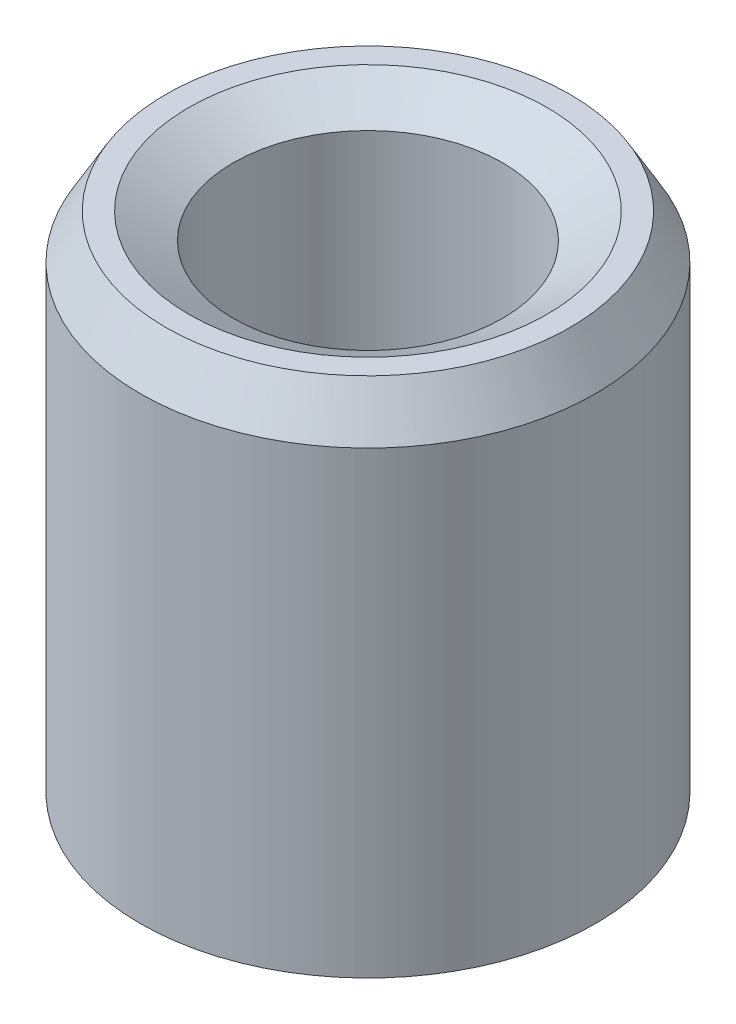
ISO-10303-21;
HEADER;
FILE_DESCRIPTION(('STEP AP214'),'2;1');
FILE_NAME('part.step','',(''),(''),'','','');
FILE_SCHEMA(('AUTOMOTIVE_DESIGN { 1 0 10303 214 1 1 1 1 }'));
ENDSEC;
DATA;
#1=APPLICATION_CONTEXT('core data for automotive mechanical design processes');
#2=APPLICATION_PROTOCOL_DEFINITION('international standard','automotive_design',2000,#1);
#3=PRODUCT_CONTEXT('',#1,'mechanical');
#4=PRODUCT('Part','Part','',(#3));
#5=PRODUCT_RELATED_PRODUCT_CATEGORY('part','',(#4));
#6=PRODUCT_DEFINITION_FORMATION('','',#4);
#7=PRODUCT_DEFINITION_CONTEXT('part definition',#1,'design');
#8=PRODUCT_DEFINITION('design','',#6,#7);
#9=PRODUCT_DEFINITION_SHAPE('','',#8);
#10=(LENGTH_UNIT() NAMED_UNIT(*) SI_UNIT(.MILLI.,.METRE.));
#11=(NAMED_UNIT(*) PLANE_ANGLE_UNIT() SI_UNIT($,.RADIAN.));
#12=(NAMED_UNIT(*) SI_UNIT($,.STERADIAN.) SOLID_ANGLE_UNIT());
#13=UNCERTAINTY_MEASURE_WITH_UNIT(LENGTH_MEASURE(1.E-05),#10,'distance_accuracy_value','');
#14=(GEOMETRIC_REPRESENTATION_CONTEXT(3) GLOBAL_UNCERTAINTY_ASSIGNED_CONTEXT((#13)) GLOBAL_UNIT_ASSIGNED_CONTEXT((#10,
#11,#12)) REPRESENTATION_CONTEXT('',''));
#15=CARTESIAN_POINT('',(0.,0.,0.));
#16=DIRECTION('',(0.,0.,1.));
#17=DIRECTION('',(1.,0.,0.));
#18=AXIS2_PLACEMENT_3D('',#15,#16,#17);
#19=CARTESIAN_POINT('',(0.,40.665113314414,0.));
#20=DIRECTION('',(0.,-1.,0.));
#21=DIRECTION('',(0.,0.,-1.));
#22=AXIS2_PLACEMENT_3D('',#19,#20,#21);
#23=CYLINDRICAL_SURFACE('',#22,17.5);
#24=CARTESIAN_POINT('',(0.,1.97186449294169,0.));
#25=DIRECTION('',(0.,1.,0.));
#26=DIRECTION('',(0.,0.,1.));
#27=AXIS2_PLACEMENT_3D('',#24,#25,#26);
#28=CIRCLE('',#27,17.5);
#29=CARTESIAN_POINT('',(0.,1.97186449294169,17.5));
#30=VERTEX_POINT('',#29);
#31=EDGE_CURVE('E10',#30,#30,#28,.T.);
#32=ORIENTED_EDGE('',*,*,#31,.T.);
#33=EDGE_LOOP('',(#32));
#34=FACE_BOUND('',#33,.T.);
#35=CARTESIAN_POINT('',(0.,37.2497438269979,0.));
#36=DIRECTION('',(0.,1.,0.));
#37=DIRECTION('',(0.,0.,1.));
#38=AXIS2_PLACEMENT_3D('',#35,#36,#37);
#39=CIRCLE('',#38,17.5);
#40=CARTESIAN_POINT('',(0.,37.2497438269979,17.5));
#41=VERTEX_POINT('',#40);
#42=EDGE_CURVE('E50',#41,#41,#39,.F.);
#43=ORIENTED_EDGE('',*,*,#42,.T.);
#44=EDGE_LOOP('',(#43));
#45=FACE_BOUND('',#44,.T.);
#46=ADVANCED_FACE('F39',(#34,#45),#23,.T.);
#47=CARTESIAN_POINT('',(0.,40.665113314414,0.));
#48=DIRECTION('',(0.,1.,0.));
#49=DIRECTION('',(0.,0.,1.));
#50=AXIS2_PLACEMENT_3D('',#47,#48,#49);
#51=PLANE('',#50);
#52=CARTESIAN_POINT('',(0.,40.665113314414,0.));
#53=DIRECTION('',(0.,1.,0.));
#54=DIRECTION('',(0.,0.,1.));
#55=AXIS2_PLACEMENT_3D('',#52,#53,#54);
#56=CIRCLE('',#55,13.7719927468305);
#57=CARTESIAN_POINT('',(0.,40.665113314414,13.7719927468305));
#58=VERTEX_POINT('',#57);
#59=EDGE_CURVE('E58',#58,#58,#56,.F.);
#60=ORIENTED_EDGE('',*,*,#59,.T.);
#61=EDGE_LOOP('',(#60));
#62=FACE_BOUND('',#61,.T.);
#63=CARTESIAN_POINT('',(0.,40.665113314414,0.));
#64=DIRECTION('',(0.,1.,0.));
#65=DIRECTION('',(0.,0.,1.));
#66=AXIS2_PLACEMENT_3D('',#63,#64,#65);
#67=CIRCLE('',#66,15.5281355070583);
#68=CARTESIAN_POINT('',(0.,40.665113314414,15.5281355070583));
#69=VERTEX_POINT('',#68);
#70=EDGE_CURVE('E61',#69,#69,#67,.T.);
#71=ORIENTED_EDGE('',*,*,#70,.T.);
#72=EDGE_LOOP('',(#71));
#73=FACE_BOUND('',#72,.T.);
#74=ADVANCED_FACE('F88',(#62,#73),#51,.T.);
#75=CARTESIAN_POINT('',(0.,0.,0.));
#76=DIRECTION('',(0.,1.,0.));
#77=DIRECTION('',(0.,0.,1.));
#78=AXIS2_PLACEMENT_3D('',#75,#76,#77);
#79=PLANE('',#78);
#80=CARTESIAN_POINT('',(0.,0.,0.));
#81=DIRECTION('',(0.,1.,0.));
#82=DIRECTION('',(0.,0.,1.));
#83=AXIS2_PLACEMENT_3D('',#80,#81,#82);
#84=CIRCLE('',#83,12.3284877523561);
#85=CARTESIAN_POINT('',(0.,0.,12.3284877523561));
#86=VERTEX_POINT('',#85);
#87=EDGE_CURVE('E51',#86,#86,#84,.T.);
#88=ORIENTED_EDGE('',*,*,#87,.T.);
#89=EDGE_LOOP('',(#88));
#90=FACE_BOUND('',#89,.T.);
#91=CARTESIAN_POINT('',(0.,0.,0.));
#92=DIRECTION('',(0.,1.,0.));
#93=DIRECTION('',(0.,0.,1.));
#94=AXIS2_PLACEMENT_3D('',#91,#92,#93);
#95=CIRCLE('',#94,14.0846305125839);
#96=CARTESIAN_POINT('',(0.,0.,14.0846305125839));
#97=VERTEX_POINT('',#96);
#98=EDGE_CURVE('E54',#97,#97,#95,.F.);
#99=ORIENTED_EDGE('',*,*,#98,.T.);
#100=EDGE_LOOP('',(#99));
#101=FACE_BOUND('',#100,.T.);
#102=ADVANCED_FACE('F83',(#90,#101),#79,.F.);
#103=CARTESIAN_POINT('',(0.,40.665113314414,0.));
#104=DIRECTION('',(0.,-1.,0.));
#105=DIRECTION('',(0.,0.,-1.));
#106=AXIS2_PLACEMENT_3D('',#103,#104,#105);
#107=CYLINDRICAL_SURFACE('',#106,10.3566232594144);
#108=CARTESIAN_POINT('',(0.,38.6932488214723,0.));
#109=DIRECTION('',(0.,1.,0.));
#110=DIRECTION('',(0.,0.,1.));
#111=AXIS2_PLACEMENT_3D('',#108,#109,#110);
#112=CIRCLE('',#111,10.3566232594144);
#113=CARTESIAN_POINT('',(0.,38.6932488214723,10.3566232594144));
#114=VERTEX_POINT('',#113);
#115=EDGE_CURVE('E67',#114,#114,#112,.T.);
#116=ORIENTED_EDGE('',*,*,#115,.T.);
#117=EDGE_LOOP('',(#116));
#118=FACE_BOUND('',#117,.T.);
#119=CARTESIAN_POINT('',(0.,3.41536948741608,0.));
#120=DIRECTION('',(0.,1.,0.));
#121=DIRECTION('',(0.,0.,1.));
#122=AXIS2_PLACEMENT_3D('',#119,#120,#121);
#123=CIRCLE('',#122,10.3566232594144);
#124=CARTESIAN_POINT('',(0.,3.41536948741608,10.3566232594144));
#125=VERTEX_POINT('',#124);
#126=EDGE_CURVE('E69',#125,#125,#123,.F.);
#127=ORIENTED_EDGE('',*,*,#126,.T.);
#128=EDGE_LOOP('',(#127));
#129=FACE_BOUND('',#128,.T.);
#130=ADVANCED_FACE('F71',(#118,#129),#107,.F.);
#131=CARTESIAN_POINT('',(0.,38.6932488214723,0.));
#132=DIRECTION('',(0.,1.,0.));
#133=DIRECTION('',(0.,0.,1.));
#134=AXIS2_PLACEMENT_3D('',#131,#132,#133);
#135=CONICAL_SURFACE('',#134,10.3566232594144,1.0471975511966);
#136=ORIENTED_EDGE('',*,*,#59,.F.);
#137=EDGE_LOOP('',(#136));
#138=FACE_BOUND('',#137,.T.);
#139=ORIENTED_EDGE('',*,*,#115,.F.);
#140=EDGE_LOOP('',(#139));
#141=FACE_BOUND('',#140,.T.);
#142=ADVANCED_FACE('F77',(#138,#141),#135,.F.);
#143=CARTESIAN_POINT('',(0.,0.,0.));
#144=DIRECTION('',(0.,-1.,0.));
#145=DIRECTION('',(0.,0.,-1.));
#146=AXIS2_PLACEMENT_3D('',#143,#144,#145);
#147=CONICAL_SURFACE('',#146,12.3284877523561,0.523598775598295);
#148=ORIENTED_EDGE('',*,*,#126,.F.);
#149=EDGE_LOOP('',(#148));
#150=FACE_BOUND('',#149,.T.);
#151=ORIENTED_EDGE('',*,*,#87,.F.);
#152=EDGE_LOOP('',(#151));
#153=FACE_BOUND('',#152,.T.);
#154=ADVANCED_FACE('F73',(#150,#153),#147,.F.);
#155=CARTESIAN_POINT('',(0.,1.97186449294169,0.));
#156=DIRECTION('',(0.,1.,0.));
#157=DIRECTION('',(0.,0.,1.));
#158=AXIS2_PLACEMENT_3D('',#155,#156,#157);
#159=CONICAL_SURFACE('',#158,17.5,1.0471975511966);
#160=ORIENTED_EDGE('',*,*,#98,.F.);
#161=EDGE_LOOP('',(#160));
#162=FACE_BOUND('',#161,.T.);
#163=ORIENTED_EDGE('',*,*,#31,.F.);
#164=EDGE_LOOP('',(#163));
#165=FACE_BOUND('',#164,.T.);
#166=ADVANCED_FACE('F76',(#162,#165),#159,.T.);
#167=CARTESIAN_POINT('',(0.,40.665113314414,0.));
#168=DIRECTION('',(0.,-1.,0.));
#169=DIRECTION('',(0.,0.,-1.));
#170=AXIS2_PLACEMENT_3D('',#167,#168,#169);
#171=CONICAL_SURFACE('',#170,15.5281355070583,0.523598775598295);
#172=ORIENTED_EDGE('',*,*,#42,.F.);
#173=EDGE_LOOP('',(#172));
#174=FACE_BOUND('',#173,.T.);
#175=ORIENTED_EDGE('',*,*,#70,.F.);
#176=EDGE_LOOP('',(#175));
#177=FACE_BOUND('',#176,.T.);
#178=ADVANCED_FACE('F45',(#174,#177),#171,.T.);
#179=CLOSED_SHELL('',(#46,#74,#102,#130,#142,#154,#166,#178));
#180=MANIFOLD_SOLID_BREP('B2',#179);
#181=ADVANCED_BREP_SHAPE_REPRESENTATION('',(#18,#180),#14);
#182=SHAPE_DEFINITION_REPRESENTATION(#9,#181);
ENDSEC;
END-ISO-10303-21;
